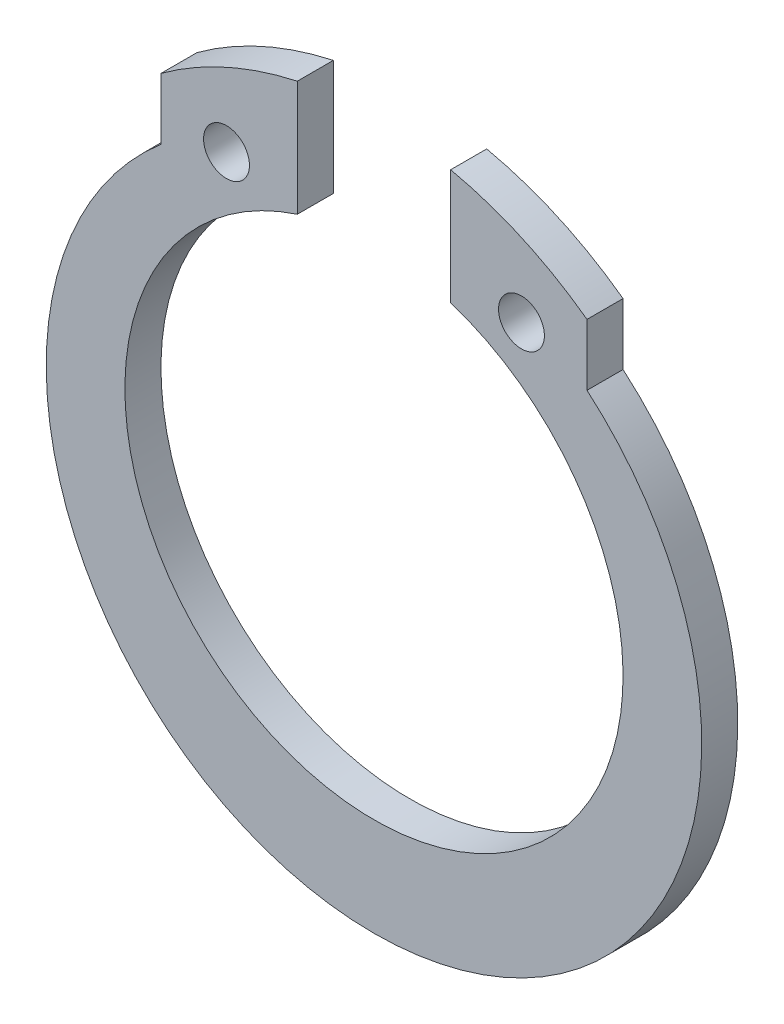
ISO-10303-21;
HEADER;
FILE_DESCRIPTION(('STEP AP214'),'2;1');
FILE_NAME('part.step','',(''),(''),'','','');
FILE_SCHEMA(('AUTOMOTIVE_DESIGN { 1 0 10303 214 1 1 1 1 }'));
ENDSEC;
DATA;
#1=APPLICATION_CONTEXT('core data for automotive mechanical design processes');
#2=APPLICATION_PROTOCOL_DEFINITION('international standard','automotive_design',2000,#1);
#3=PRODUCT_CONTEXT('',#1,'mechanical');
#4=PRODUCT('Part','Part','',(#3));
#5=PRODUCT_RELATED_PRODUCT_CATEGORY('part','',(#4));
#6=PRODUCT_DEFINITION_FORMATION('','',#4);
#7=PRODUCT_DEFINITION_CONTEXT('part definition',#1,'design');
#8=PRODUCT_DEFINITION('design','',#6,#7);
#9=PRODUCT_DEFINITION_SHAPE('','',#8);
#10=(LENGTH_UNIT() NAMED_UNIT(*) SI_UNIT(.MILLI.,.METRE.));
#11=(NAMED_UNIT(*) PLANE_ANGLE_UNIT() SI_UNIT($,.RADIAN.));
#12=(NAMED_UNIT(*) SI_UNIT($,.STERADIAN.) SOLID_ANGLE_UNIT());
#13=UNCERTAINTY_MEASURE_WITH_UNIT(LENGTH_MEASURE(1.E-05),#10,'distance_accuracy_value','');
#14=(GEOMETRIC_REPRESENTATION_CONTEXT(3) GLOBAL_UNCERTAINTY_ASSIGNED_CONTEXT((#13)) GLOBAL_UNIT_ASSIGNED_CONTEXT((#10,
#11,#12)) REPRESENTATION_CONTEXT('',''));
#15=CARTESIAN_POINT('',(0.,0.,0.));
#16=DIRECTION('',(0.,0.,1.));
#17=DIRECTION('',(1.,0.,0.));
#18=AXIS2_PLACEMENT_3D('',#15,#16,#17);
#19=CARTESIAN_POINT('',(0.,0.3,-0.55));
#20=DIRECTION('',(0.,0.,1.));
#21=DIRECTION('',(1.,0.,0.));
#22=AXIS2_PLACEMENT_3D('',#19,#20,#21);
#23=CYLINDRICAL_SURFACE('',#22,5.5);
#24=DIRECTION('',(0.,0.,1.));
#25=VECTOR('',#24,1.);
#26=CARTESIAN_POINT('',(-1.17,5.67411388044578,-0.55));
#27=LINE('',#26,#25);
#28=CARTESIAN_POINT('',(-1.17,5.67411388044578,-0.55));
#29=VERTEX_POINT('',#28);
#30=CARTESIAN_POINT('',(-1.17,5.67411388044578,0.));
#31=VERTEX_POINT('',#30);
#32=EDGE_CURVE('E105',#29,#31,#27,.T.);
#33=ORIENTED_EDGE('',*,*,#32,.F.);
#34=CARTESIAN_POINT('',(0.,0.3,-0.55));
#35=DIRECTION('',(0.,0.,1.));
#36=DIRECTION('',(1.,0.,0.));
#37=AXIS2_PLACEMENT_3D('',#34,#35,#36);
#38=CIRCLE('',#37,5.5);
#39=CARTESIAN_POINT('',(-3.25,4.73705983732471,-0.55));
#40=VERTEX_POINT('',#39);
#41=EDGE_CURVE('E122',#29,#40,#38,.T.);
#42=ORIENTED_EDGE('',*,*,#41,.T.);
#43=DIRECTION('',(0.,0.,1.));
#44=VECTOR('',#43,1.);
#45=CARTESIAN_POINT('',(-3.25,4.73705983732471,-0.55));
#46=LINE('',#45,#44);
#47=CARTESIAN_POINT('',(-3.25,4.73705983732471,0.));
#48=VERTEX_POINT('',#47);
#49=EDGE_CURVE('E124',#40,#48,#46,.T.);
#50=ORIENTED_EDGE('',*,*,#49,.T.);
#51=CARTESIAN_POINT('',(0.,0.3,0.));
#52=DIRECTION('',(0.,0.,1.));
#53=DIRECTION('',(1.,0.,0.));
#54=AXIS2_PLACEMENT_3D('',#51,#52,#53);
#55=CIRCLE('',#54,5.5);
#56=EDGE_CURVE('E139',#31,#48,#55,.T.);
#57=ORIENTED_EDGE('',*,*,#56,.F.);
#58=EDGE_LOOP('',(#33,#42,#50,#57));
#59=FACE_BOUND('',#58,.T.);
#60=ADVANCED_FACE('F35',(#59),#23,.T.);
#61=CARTESIAN_POINT('',(3.25,4.73705983732471,-0.55));
#62=DIRECTION('',(-1.,0.,0.));
#63=DIRECTION('',(0.,0.,1.));
#64=AXIS2_PLACEMENT_3D('',#61,#62,#63);
#65=PLANE('',#64);
#66=DIRECTION('',(0.,-1.,0.));
#67=VECTOR('',#66,1.);
#68=CARTESIAN_POINT('',(3.25,4.73705983732471,0.));
#69=LINE('',#68,#67);
#70=CARTESIAN_POINT('',(3.25,4.73705983732471,0.));
#71=VERTEX_POINT('',#70);
#72=CARTESIAN_POINT('',(3.25,3.79967103839267,0.));
#73=VERTEX_POINT('',#72);
#74=EDGE_CURVE('E130',#71,#73,#69,.T.);
#75=ORIENTED_EDGE('',*,*,#74,.T.);
#76=DIRECTION('',(0.,0.,1.));
#77=VECTOR('',#76,1.);
#78=CARTESIAN_POINT('',(3.25,3.79967103839267,-0.55));
#79=LINE('',#78,#77);
#80=CARTESIAN_POINT('',(3.25,3.79967103839267,-0.55));
#81=VERTEX_POINT('',#80);
#82=EDGE_CURVE('E11',#81,#73,#79,.T.);
#83=ORIENTED_EDGE('',*,*,#82,.F.);
#84=DIRECTION('',(0.,-1.,0.));
#85=VECTOR('',#84,1.);
#86=CARTESIAN_POINT('',(3.25,4.73705983732471,-0.55));
#87=LINE('',#86,#85);
#88=CARTESIAN_POINT('',(3.25,4.73705983732471,-0.55));
#89=VERTEX_POINT('',#88);
#90=EDGE_CURVE('E141',#89,#81,#87,.T.);
#91=ORIENTED_EDGE('',*,*,#90,.F.);
#92=DIRECTION('',(0.,0.,1.));
#93=VECTOR('',#92,1.);
#94=CARTESIAN_POINT('',(3.25,4.73705983732471,-0.55));
#95=LINE('',#94,#93);
#96=EDGE_CURVE('E120',#89,#71,#95,.T.);
#97=ORIENTED_EDGE('',*,*,#96,.T.);
#98=EDGE_LOOP('',(#75,#83,#91,#97));
#99=FACE_BOUND('',#98,.T.);
#100=ADVANCED_FACE('F37',(#99),#65,.F.);
#101=CARTESIAN_POINT('',(0.,0.,-0.55));
#102=DIRECTION('',(0.,0.,1.));
#103=DIRECTION('',(1.,0.,0.));
#104=AXIS2_PLACEMENT_3D('',#101,#102,#103);
#105=CYLINDRICAL_SURFACE('',#104,5.);
#106=CARTESIAN_POINT('',(0.,0.,0.));
#107=DIRECTION('',(0.,0.,1.));
#108=DIRECTION('',(1.,0.,0.));
#109=AXIS2_PLACEMENT_3D('',#106,#107,#108);
#110=CIRCLE('',#109,5.);
#111=CARTESIAN_POINT('',(-3.25,3.79967103839267,0.));
#112=VERTEX_POINT('',#111);
#113=EDGE_CURVE('E133',#112,#73,#110,.T.);
#114=ORIENTED_EDGE('',*,*,#113,.F.);
#115=DIRECTION('',(0.,0.,1.));
#116=VECTOR('',#115,1.);
#117=CARTESIAN_POINT('',(-3.25,3.79967103839267,-0.55));
#118=LINE('',#117,#116);
#119=CARTESIAN_POINT('',(-3.25,3.79967103839267,-0.55));
#120=VERTEX_POINT('',#119);
#121=EDGE_CURVE('E43',#120,#112,#118,.T.);
#122=ORIENTED_EDGE('',*,*,#121,.F.);
#123=CARTESIAN_POINT('',(0.,0.,-0.55));
#124=DIRECTION('',(0.,0.,1.));
#125=DIRECTION('',(1.,0.,0.));
#126=AXIS2_PLACEMENT_3D('',#123,#124,#125);
#127=CIRCLE('',#126,5.);
#128=EDGE_CURVE('E163',#120,#81,#127,.T.);
#129=ORIENTED_EDGE('',*,*,#128,.T.);
#130=ORIENTED_EDGE('',*,*,#82,.T.);
#131=EDGE_LOOP('',(#114,#122,#129,#130));
#132=FACE_BOUND('',#131,.T.);
#133=ADVANCED_FACE('F154',(#132),#105,.T.);
#134=CARTESIAN_POINT('',(-3.25,4.73705983732471,-0.55));
#135=DIRECTION('',(-1.,0.,0.));
#136=DIRECTION('',(0.,0.,1.));
#137=AXIS2_PLACEMENT_3D('',#134,#135,#136);
#138=PLANE('',#137);
#139=DIRECTION('',(0.,-1.,0.));
#140=VECTOR('',#139,1.);
#141=CARTESIAN_POINT('',(-3.25,4.73705983732471,0.));
#142=LINE('',#141,#140);
#143=EDGE_CURVE('E136',#48,#112,#142,.T.);
#144=ORIENTED_EDGE('',*,*,#143,.F.);
#145=ORIENTED_EDGE('',*,*,#49,.F.);
#146=DIRECTION('',(0.,-1.,0.));
#147=VECTOR('',#146,1.);
#148=CARTESIAN_POINT('',(-3.25,4.73705983732471,-0.55));
#149=LINE('',#148,#147);
#150=EDGE_CURVE('E126',#40,#120,#149,.T.);
#151=ORIENTED_EDGE('',*,*,#150,.T.);
#152=ORIENTED_EDGE('',*,*,#121,.T.);
#153=EDGE_LOOP('',(#144,#145,#151,#152));
#154=FACE_BOUND('',#153,.T.);
#155=ADVANCED_FACE('F148',(#154),#138,.T.);
#156=DIRECTION('',(0.,0.,1.));
#157=VECTOR('',#156,1.);
#158=CARTESIAN_POINT('',(1.17,5.67411388044578,-0.55));
#159=LINE('',#158,#157);
#160=CARTESIAN_POINT('',(1.17,5.67411388044578,-0.55));
#161=VERTEX_POINT('',#160);
#162=CARTESIAN_POINT('',(1.17,5.67411388044578,0.));
#163=VERTEX_POINT('',#162);
#164=EDGE_CURVE('E97',#161,#163,#159,.T.);
#165=ORIENTED_EDGE('',*,*,#164,.T.);
#166=EDGE_CURVE('E140',#71,#163,#55,.T.);
#167=ORIENTED_EDGE('',*,*,#166,.F.);
#168=ORIENTED_EDGE('',*,*,#96,.F.);
#169=EDGE_CURVE('E113',#89,#161,#38,.T.);
#170=ORIENTED_EDGE('',*,*,#169,.T.);
#171=EDGE_LOOP('',(#165,#167,#168,#170));
#172=FACE_BOUND('',#171,.T.);
#173=ADVANCED_FACE('F119',(#172),#23,.T.);
#174=CARTESIAN_POINT('',(0.,0.,-0.55));
#175=DIRECTION('',(0.,0.,1.));
#176=DIRECTION('',(1.,0.,0.));
#177=AXIS2_PLACEMENT_3D('',#174,#175,#176);
#178=PLANE('',#177);
#179=CARTESIAN_POINT('',(-2.25,4.19711431702997,-0.55));
#180=DIRECTION('',(0.,0.,1.));
#181=DIRECTION('',(1.,0.,0.));
#182=AXIS2_PLACEMENT_3D('',#179,#180,#181);
#183=CIRCLE('',#182,0.35);
#184=CARTESIAN_POINT('',(-1.9,4.19711431702997,-0.55));
#185=VERTEX_POINT('',#184);
#186=EDGE_CURVE('E183',#185,#185,#183,.T.);
#187=ORIENTED_EDGE('',*,*,#186,.T.);
#188=EDGE_LOOP('',(#187));
#189=FACE_BOUND('',#188,.T.);
#190=CARTESIAN_POINT('',(2.25,4.19711431702997,-0.55));
#191=DIRECTION('',(0.,0.,1.));
#192=DIRECTION('',(1.,0.,0.));
#193=AXIS2_PLACEMENT_3D('',#190,#191,#192);
#194=CIRCLE('',#193,0.35);
#195=CARTESIAN_POINT('',(2.6,4.19711431702997,-0.55));
#196=VERTEX_POINT('',#195);
#197=EDGE_CURVE('E176',#196,#196,#194,.T.);
#198=ORIENTED_EDGE('',*,*,#197,.T.);
#199=EDGE_LOOP('',(#198));
#200=FACE_BOUND('',#199,.T.);
#201=ORIENTED_EDGE('',*,*,#41,.F.);
#202=DIRECTION('',(0.,-1.,0.));
#203=VECTOR('',#202,1.);
#204=CARTESIAN_POINT('',(-1.17,5.67411388044578,-0.55));
#205=LINE('',#204,#203);
#206=CARTESIAN_POINT('',(-1.17,3.91539762681783,-0.55));
#207=VERTEX_POINT('',#206);
#208=EDGE_CURVE('E117',#29,#207,#205,.T.);
#209=ORIENTED_EDGE('',*,*,#208,.T.);
#210=CARTESIAN_POINT('',(0.,0.3,-0.55));
#211=DIRECTION('',(0.,0.,1.));
#212=DIRECTION('',(1.,0.,0.));
#213=AXIS2_PLACEMENT_3D('',#210,#211,#212);
#214=CIRCLE('',#213,3.8);
#215=CARTESIAN_POINT('',(1.17,3.91539762681783,-0.55));
#216=VERTEX_POINT('',#215);
#217=EDGE_CURVE('E116',#207,#216,#214,.T.);
#218=ORIENTED_EDGE('',*,*,#217,.T.);
#219=DIRECTION('',(0.,1.,0.));
#220=VECTOR('',#219,1.);
#221=CARTESIAN_POINT('',(1.17,5.67411388044578,-0.55));
#222=LINE('',#221,#220);
#223=EDGE_CURVE('E58',#216,#161,#222,.T.);
#224=ORIENTED_EDGE('',*,*,#223,.T.);
#225=ORIENTED_EDGE('',*,*,#169,.F.);
#226=ORIENTED_EDGE('',*,*,#90,.T.);
#227=ORIENTED_EDGE('',*,*,#128,.F.);
#228=ORIENTED_EDGE('',*,*,#150,.F.);
#229=EDGE_LOOP('',(#201,#209,#218,#224,#225,#226,#227,#228));
#230=FACE_BOUND('',#229,.T.);
#231=ADVANCED_FACE('F112',(#189,#200,#230),#178,.F.);
#232=CARTESIAN_POINT('',(0.,0.,0.));
#233=DIRECTION('',(0.,0.,1.));
#234=DIRECTION('',(1.,0.,0.));
#235=AXIS2_PLACEMENT_3D('',#232,#233,#234);
#236=PLANE('',#235);
#237=CARTESIAN_POINT('',(-2.25,4.19711431702997,0.));
#238=DIRECTION('',(0.,0.,1.));
#239=DIRECTION('',(1.,0.,0.));
#240=AXIS2_PLACEMENT_3D('',#237,#238,#239);
#241=CIRCLE('',#240,0.35);
#242=CARTESIAN_POINT('',(-1.9,4.19711431702997,0.));
#243=VERTEX_POINT('',#242);
#244=EDGE_CURVE('E186',#243,#243,#241,.T.);
#245=ORIENTED_EDGE('',*,*,#244,.F.);
#246=EDGE_LOOP('',(#245));
#247=FACE_BOUND('',#246,.T.);
#248=CARTESIAN_POINT('',(2.25,4.19711431702997,0.));
#249=DIRECTION('',(0.,0.,1.));
#250=DIRECTION('',(1.,0.,0.));
#251=AXIS2_PLACEMENT_3D('',#248,#249,#250);
#252=CIRCLE('',#251,0.35);
#253=CARTESIAN_POINT('',(2.6,4.19711431702997,0.));
#254=VERTEX_POINT('',#253);
#255=EDGE_CURVE('E180',#254,#254,#252,.T.);
#256=ORIENTED_EDGE('',*,*,#255,.F.);
#257=EDGE_LOOP('',(#256));
#258=FACE_BOUND('',#257,.T.);
#259=DIRECTION('',(0.,-1.,0.));
#260=VECTOR('',#259,1.);
#261=CARTESIAN_POINT('',(-1.17,5.67411388044578,0.));
#262=LINE('',#261,#260);
#263=CARTESIAN_POINT('',(-1.17,3.91539762681783,0.));
#264=VERTEX_POINT('',#263);
#265=EDGE_CURVE('E50',#31,#264,#262,.T.);
#266=ORIENTED_EDGE('',*,*,#265,.F.);
#267=ORIENTED_EDGE('',*,*,#56,.T.);
#268=ORIENTED_EDGE('',*,*,#143,.T.);
#269=ORIENTED_EDGE('',*,*,#113,.T.);
#270=ORIENTED_EDGE('',*,*,#74,.F.);
#271=ORIENTED_EDGE('',*,*,#166,.T.);
#272=DIRECTION('',(0.,1.,0.));
#273=VECTOR('',#272,1.);
#274=CARTESIAN_POINT('',(1.17,5.67411388044578,0.));
#275=LINE('',#274,#273);
#276=CARTESIAN_POINT('',(1.17,3.91539762681783,0.));
#277=VERTEX_POINT('',#276);
#278=EDGE_CURVE('E100',#277,#163,#275,.T.);
#279=ORIENTED_EDGE('',*,*,#278,.F.);
#280=CARTESIAN_POINT('',(0.,0.3,0.));
#281=DIRECTION('',(0.,0.,1.));
#282=DIRECTION('',(1.,0.,0.));
#283=AXIS2_PLACEMENT_3D('',#280,#281,#282);
#284=CIRCLE('',#283,3.8);
#285=EDGE_CURVE('E166',#264,#277,#284,.T.);
#286=ORIENTED_EDGE('',*,*,#285,.F.);
#287=EDGE_LOOP('',(#266,#267,#268,#269,#270,#271,#279,#286));
#288=FACE_BOUND('',#287,.T.);
#289=ADVANCED_FACE('F158',(#247,#258,#288),#236,.T.);
#290=CARTESIAN_POINT('',(0.,0.3,-0.55));
#291=DIRECTION('',(0.,0.,1.));
#292=DIRECTION('',(1.,0.,0.));
#293=AXIS2_PLACEMENT_3D('',#290,#291,#292);
#294=CYLINDRICAL_SURFACE('',#293,3.8);
#295=ORIENTED_EDGE('',*,*,#217,.F.);
#296=DIRECTION('',(0.,0.,1.));
#297=VECTOR('',#296,1.);
#298=CARTESIAN_POINT('',(-1.17,3.91539762681783,-0.55));
#299=LINE('',#298,#297);
#300=EDGE_CURVE('E169',#207,#264,#299,.T.);
#301=ORIENTED_EDGE('',*,*,#300,.T.);
#302=ORIENTED_EDGE('',*,*,#285,.T.);
#303=DIRECTION('',(0.,0.,1.));
#304=VECTOR('',#303,1.);
#305=CARTESIAN_POINT('',(1.17,3.91539762681783,-0.55));
#306=LINE('',#305,#304);
#307=EDGE_CURVE('E106',#216,#277,#306,.T.);
#308=ORIENTED_EDGE('',*,*,#307,.F.);
#309=EDGE_LOOP('',(#295,#301,#302,#308));
#310=FACE_BOUND('',#309,.T.);
#311=ADVANCED_FACE('F194',(#310),#294,.F.);
#312=CARTESIAN_POINT('',(1.17,5.67411388044578,-0.55));
#313=DIRECTION('',(1.,0.,0.));
#314=DIRECTION('',(0.,0.,-1.));
#315=AXIS2_PLACEMENT_3D('',#312,#313,#314);
#316=PLANE('',#315);
#317=ORIENTED_EDGE('',*,*,#278,.T.);
#318=ORIENTED_EDGE('',*,*,#164,.F.);
#319=ORIENTED_EDGE('',*,*,#223,.F.);
#320=ORIENTED_EDGE('',*,*,#307,.T.);
#321=EDGE_LOOP('',(#317,#318,#319,#320));
#322=FACE_BOUND('',#321,.T.);
#323=ADVANCED_FACE('F98',(#322),#316,.F.);
#324=CARTESIAN_POINT('',(-1.17,5.67411388044578,-0.55));
#325=DIRECTION('',(-1.,0.,0.));
#326=DIRECTION('',(0.,0.,1.));
#327=AXIS2_PLACEMENT_3D('',#324,#325,#326);
#328=PLANE('',#327);
#329=ORIENTED_EDGE('',*,*,#265,.T.);
#330=ORIENTED_EDGE('',*,*,#300,.F.);
#331=ORIENTED_EDGE('',*,*,#208,.F.);
#332=ORIENTED_EDGE('',*,*,#32,.T.);
#333=EDGE_LOOP('',(#329,#330,#331,#332));
#334=FACE_BOUND('',#333,.T.);
#335=ADVANCED_FACE('F200',(#334),#328,.F.);
#336=CARTESIAN_POINT('',(2.25,4.19711431702997,0.));
#337=DIRECTION('',(0.,0.,1.));
#338=DIRECTION('',(1.,0.,0.));
#339=AXIS2_PLACEMENT_3D('',#336,#337,#338);
#340=CYLINDRICAL_SURFACE('',#339,0.35);
#341=ORIENTED_EDGE('',*,*,#197,.F.);
#342=EDGE_LOOP('',(#341));
#343=FACE_BOUND('',#342,.T.);
#344=ORIENTED_EDGE('',*,*,#255,.T.);
#345=EDGE_LOOP('',(#344));
#346=FACE_BOUND('',#345,.T.);
#347=ADVANCED_FACE('F198',(#343,#346),#340,.F.);
#348=CARTESIAN_POINT('',(-2.25,4.19711431702997,0.));
#349=DIRECTION('',(0.,0.,1.));
#350=DIRECTION('',(1.,0.,0.));
#351=AXIS2_PLACEMENT_3D('',#348,#349,#350);
#352=CYLINDRICAL_SURFACE('',#351,0.35);
#353=ORIENTED_EDGE('',*,*,#186,.F.);
#354=EDGE_LOOP('',(#353));
#355=FACE_BOUND('',#354,.T.);
#356=ORIENTED_EDGE('',*,*,#244,.T.);
#357=EDGE_LOOP('',(#356));
#358=FACE_BOUND('',#357,.T.);
#359=ADVANCED_FACE('F190',(#355,#358),#352,.F.);
#360=CLOSED_SHELL('',(#60,#100,#133,#155,#173,#231,#289,#311,#323,#335,#347,#359));
#361=MANIFOLD_SOLID_BREP('B2',#360);
#362=ADVANCED_BREP_SHAPE_REPRESENTATION('',(#18,#361),#14);
#363=SHAPE_DEFINITION_REPRESENTATION(#9,#362);
ENDSEC;
END-ISO-10303-21;
